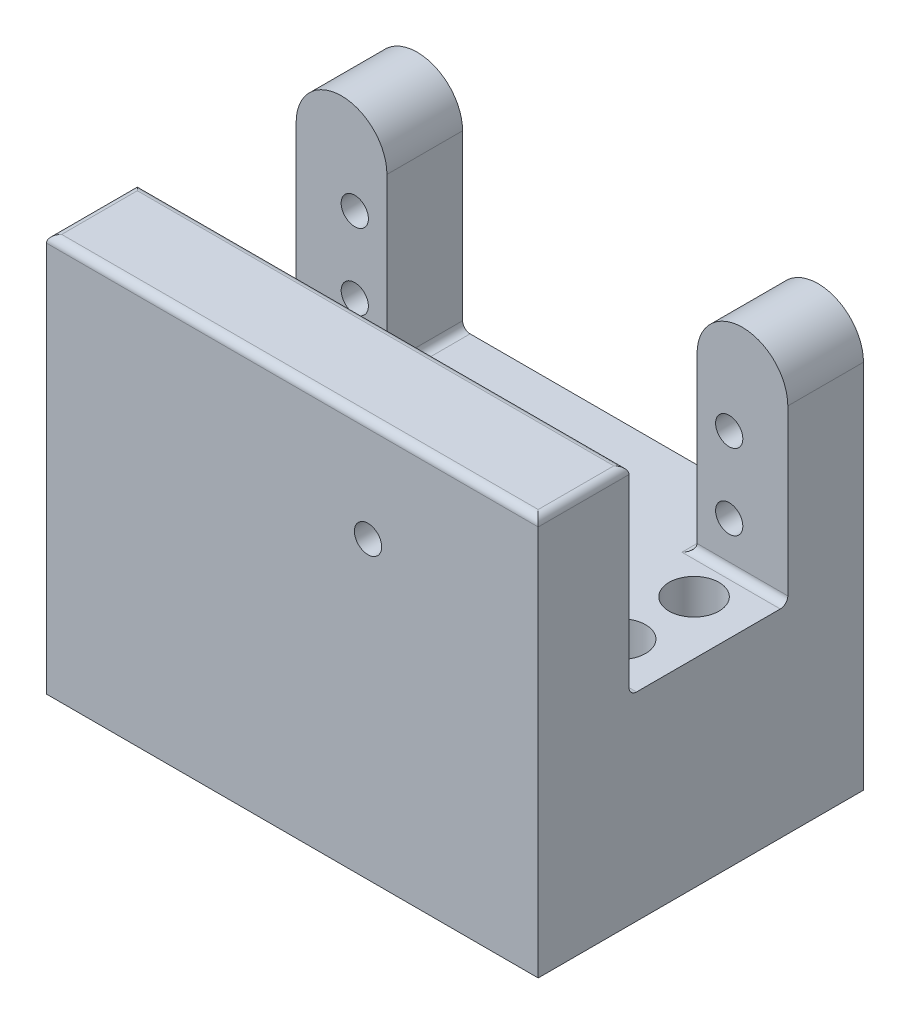
ISO-10303-21;
HEADER;
FILE_DESCRIPTION(('STEP AP214'),'2;1');
FILE_NAME('part.step','',(''),(''),'','','');
FILE_SCHEMA(('AUTOMOTIVE_DESIGN { 1 0 10303 214 1 1 1 1 }'));
ENDSEC;
DATA;
#1=APPLICATION_CONTEXT('core data for automotive mechanical design processes');
#2=APPLICATION_PROTOCOL_DEFINITION('international standard','automotive_design',2000,#1);
#3=PRODUCT_CONTEXT('',#1,'mechanical');
#4=PRODUCT('Part','Part','',(#3));
#5=PRODUCT_RELATED_PRODUCT_CATEGORY('part','',(#4));
#6=PRODUCT_DEFINITION_FORMATION('','',#4);
#7=PRODUCT_DEFINITION_CONTEXT('part definition',#1,'design');
#8=PRODUCT_DEFINITION('design','',#6,#7);
#9=PRODUCT_DEFINITION_SHAPE('','',#8);
#10=(LENGTH_UNIT() NAMED_UNIT(*) SI_UNIT(.MILLI.,.METRE.));
#11=(NAMED_UNIT(*) PLANE_ANGLE_UNIT() SI_UNIT($,.RADIAN.));
#12=(NAMED_UNIT(*) SI_UNIT($,.STERADIAN.) SOLID_ANGLE_UNIT());
#13=UNCERTAINTY_MEASURE_WITH_UNIT(LENGTH_MEASURE(1.E-05),#10,'distance_accuracy_value','');
#14=(GEOMETRIC_REPRESENTATION_CONTEXT(3) GLOBAL_UNCERTAINTY_ASSIGNED_CONTEXT((#13)) GLOBAL_UNIT_ASSIGNED_CONTEXT((#10,
#11,#12)) REPRESENTATION_CONTEXT('',''));
#15=CARTESIAN_POINT('',(0.,0.,0.));
#16=DIRECTION('',(0.,0.,1.));
#17=DIRECTION('',(1.,0.,0.));
#18=AXIS2_PLACEMENT_3D('',#15,#16,#17);
#19=CARTESIAN_POINT('',(0.,0.,31.));
#20=DIRECTION('',(0.,0.,1.));
#21=DIRECTION('',(1.,0.,0.));
#22=AXIS2_PLACEMENT_3D('',#19,#20,#21);
#23=PLANE('',#22);
#24=CARTESIAN_POINT('',(-16.4999999954684,4.31315850283263,31.));
#25=DIRECTION('',(0.,0.,1.));
#26=DIRECTION('',(1.,0.,0.));
#27=AXIS2_PLACEMENT_3D('',#24,#25,#26);
#28=CIRCLE('',#27,1.8);
#29=CARTESIAN_POINT('',(-14.6999999954684,4.31315850283263,31.));
#30=VERTEX_POINT('',#29);
#31=EDGE_CURVE('E216',#30,#30,#28,.F.);
#32=ORIENTED_EDGE('',*,*,#31,.F.);
#33=EDGE_LOOP('',(#32));
#34=FACE_BOUND('',#33,.T.);
#35=DIRECTION('',(0.,-1.,0.));
#36=VECTOR('',#35,1.);
#37=CARTESIAN_POINT('',(-59.,-20.6976744186047,31.));
#38=LINE('',#37,#36);
#39=CARTESIAN_POINT('',(-59.,16.9392946847438,31.));
#40=VERTEX_POINT('',#39);
#41=CARTESIAN_POINT('',(-59.,-7.44767441860465,31.));
#42=VERTEX_POINT('',#41);
#43=EDGE_CURVE('E284',#40,#42,#38,.T.);
#44=ORIENTED_EDGE('',*,*,#43,.F.);
#45=DIRECTION('',(-1.,0.,0.));
#46=VECTOR('',#45,1.);
#47=CARTESIAN_POINT('',(0.,16.9392946847438,31.));
#48=LINE('',#47,#46);
#49=CARTESIAN_POINT('',(6.00000000000001,16.9392946847438,31.));
#50=VERTEX_POINT('',#49);
#51=EDGE_CURVE('E345',#40,#50,#48,.F.);
#52=ORIENTED_EDGE('',*,*,#51,.T.);
#53=DIRECTION('',(0.,1.,0.));
#54=VECTOR('',#53,1.);
#55=CARTESIAN_POINT('',(6.00000000000001,-20.6976744186046,31.));
#56=LINE('',#55,#54);
#57=CARTESIAN_POINT('',(6.00000000000001,-7.44767441860465,31.));
#58=VERTEX_POINT('',#57);
#59=EDGE_CURVE('E278',#58,#50,#56,.T.);
#60=ORIENTED_EDGE('',*,*,#59,.F.);
#61=DIRECTION('',(1.,0.,0.));
#62=VECTOR('',#61,1.);
#63=CARTESIAN_POINT('',(0.,-7.44767441860465,31.));
#64=LINE('',#63,#62);
#65=EDGE_CURVE('E342',#58,#42,#64,.F.);
#66=ORIENTED_EDGE('',*,*,#65,.T.);
#67=EDGE_LOOP('',(#44,#52,#60,#66));
#68=FACE_BOUND('',#67,.T.);
#69=ADVANCED_FACE('F39',(#34,#68),#23,.F.);
#70=CARTESIAN_POINT('',(-6.,14.3023255813954,10.));
#71=DIRECTION('',(1.,0.,0.));
#72=DIRECTION('',(0.,1.,0.));
#73=AXIS2_PLACEMENT_3D('',#70,#71,#72);
#74=PLANE('',#73);
#75=DIRECTION('',(0.,-1.,0.));
#76=VECTOR('',#75,1.);
#77=CARTESIAN_POINT('',(-6.,14.3023255813954,0.));
#78=LINE('',#77,#76);
#79=CARTESIAN_POINT('',(-6.,14.3023255813954,0.));
#80=VERTEX_POINT('',#79);
#81=CARTESIAN_POINT('',(-6.,-7.44767441860465,0.));
#82=VERTEX_POINT('',#81);
#83=EDGE_CURVE('E313',#80,#82,#78,.T.);
#84=ORIENTED_EDGE('',*,*,#83,.T.);
#85=DIRECTION('',(0.,0.,1.));
#86=VECTOR('',#85,1.);
#87=CARTESIAN_POINT('',(-6.,-7.44767441860465,10.));
#88=LINE('',#87,#86);
#89=CARTESIAN_POINT('',(-6.,-7.44767441860465,10.));
#90=VERTEX_POINT('',#89);
#91=EDGE_CURVE('E378',#82,#90,#88,.T.);
#92=ORIENTED_EDGE('',*,*,#91,.T.);
#93=DIRECTION('',(0.,-1.,0.));
#94=VECTOR('',#93,1.);
#95=CARTESIAN_POINT('',(-6.,14.3023255813954,10.));
#96=LINE('',#95,#94);
#97=CARTESIAN_POINT('',(-6.,14.3023255813954,10.));
#98=VERTEX_POINT('',#97);
#99=EDGE_CURVE('E302',#98,#90,#96,.T.);
#100=ORIENTED_EDGE('',*,*,#99,.F.);
#101=DIRECTION('',(0.,0.,-1.));
#102=VECTOR('',#101,1.);
#103=CARTESIAN_POINT('',(-6.,14.3023255813954,10.));
#104=LINE('',#103,#102);
#105=EDGE_CURVE('E321',#98,#80,#104,.T.);
#106=ORIENTED_EDGE('',*,*,#105,.T.);
#107=EDGE_LOOP('',(#84,#92,#100,#106));
#108=FACE_BOUND('',#107,.T.);
#109=ADVANCED_FACE('F454',(#108),#74,.F.);
#110=CARTESIAN_POINT('',(-47.,-20.6976744186046,31.));
#111=DIRECTION('',(-1.,0.,0.));
#112=DIRECTION('',(0.,0.,1.));
#113=AXIS2_PLACEMENT_3D('',#110,#111,#112);
#114=PLANE('',#113);
#115=DIRECTION('',(0.,-1.,0.));
#116=VECTOR('',#115,1.);
#117=CARTESIAN_POINT('',(-47.,14.3023255813954,10.));
#118=LINE('',#117,#116);
#119=CARTESIAN_POINT('',(-47.,14.3023255813954,10.));
#120=VERTEX_POINT('',#119);
#121=CARTESIAN_POINT('',(-47.,-7.44767441860465,10.));
#122=VERTEX_POINT('',#121);
#123=EDGE_CURVE('E262',#120,#122,#118,.T.);
#124=ORIENTED_EDGE('',*,*,#123,.T.);
#125=DIRECTION('',(0.,0.,1.));
#126=VECTOR('',#125,1.);
#127=CARTESIAN_POINT('',(-47.,-7.44767441860465,31.));
#128=LINE('',#127,#126);
#129=CARTESIAN_POINT('',(-47.,-7.44767441860465,0.));
#130=VERTEX_POINT('',#129);
#131=EDGE_CURVE('E57',#122,#130,#128,.F.);
#132=ORIENTED_EDGE('',*,*,#131,.T.);
#133=DIRECTION('',(0.,-1.,0.));
#134=VECTOR('',#133,1.);
#135=CARTESIAN_POINT('',(-47.,14.3023255813954,0.));
#136=LINE('',#135,#134);
#137=CARTESIAN_POINT('',(-47.,14.3023255813954,0.));
#138=VERTEX_POINT('',#137);
#139=EDGE_CURVE('E180',#138,#130,#136,.T.);
#140=ORIENTED_EDGE('',*,*,#139,.F.);
#141=DIRECTION('',(0.,0.,-1.));
#142=VECTOR('',#141,1.);
#143=CARTESIAN_POINT('',(-47.,14.3023255813954,10.));
#144=LINE('',#143,#142);
#145=EDGE_CURVE('E265',#120,#138,#144,.T.);
#146=ORIENTED_EDGE('',*,*,#145,.F.);
#147=EDGE_LOOP('',(#124,#132,#140,#146));
#148=FACE_BOUND('',#147,.T.);
#149=ADVANCED_FACE('F497',(#148),#114,.F.);
#150=CARTESIAN_POINT('',(0.,14.3023255813954,10.));
#151=DIRECTION('',(0.,0.,-1.));
#152=DIRECTION('',(-1.,0.,0.));
#153=AXIS2_PLACEMENT_3D('',#150,#151,#152);
#154=PLANE('',#153);
#155=ORIENTED_EDGE('',*,*,#99,.T.);
#156=DIRECTION('',(1.,0.,0.));
#157=VECTOR('',#156,1.);
#158=CARTESIAN_POINT('',(0.,-7.44767441860465,10.));
#159=LINE('',#158,#157);
#160=CARTESIAN_POINT('',(6.,-7.44767441860465,10.));
#161=VERTEX_POINT('',#160);
#162=EDGE_CURVE('E374',#90,#161,#159,.T.);
#163=ORIENTED_EDGE('',*,*,#162,.T.);
#164=DIRECTION('',(0.,1.,0.));
#165=VECTOR('',#164,1.);
#166=CARTESIAN_POINT('',(6.,14.3023255813954,10.));
#167=LINE('',#166,#165);
#168=CARTESIAN_POINT('',(6.,14.3023255813954,10.));
#169=VERTEX_POINT('',#168);
#170=EDGE_CURVE('E306',#161,#169,#167,.T.);
#171=ORIENTED_EDGE('',*,*,#170,.T.);
#172=CARTESIAN_POINT('',(0.,14.3023255813954,10.));
#173=DIRECTION('',(0.,0.,1.));
#174=DIRECTION('',(-1.,0.,0.));
#175=AXIS2_PLACEMENT_3D('',#172,#173,#174);
#176=CIRCLE('',#175,6.);
#177=EDGE_CURVE('E298',#169,#98,#176,.T.);
#178=ORIENTED_EDGE('',*,*,#177,.T.);
#179=EDGE_LOOP('',(#155,#163,#171,#178));
#180=FACE_BOUND('',#179,.T.);
#181=CARTESIAN_POINT('',(-1.75,-2.44781916033438,10.));
#182=DIRECTION('',(0.,0.,-1.));
#183=DIRECTION('',(-1.,0.,0.));
#184=AXIS2_PLACEMENT_3D('',#181,#182,#183);
#185=CIRCLE('',#184,1.8);
#186=CARTESIAN_POINT('',(-3.55,-2.44781916033438,10.));
#187=VERTEX_POINT('',#186);
#188=EDGE_CURVE('E232',#187,#187,#185,.F.);
#189=ORIENTED_EDGE('',*,*,#188,.F.);
#190=EDGE_LOOP('',(#189));
#191=FACE_BOUND('',#190,.T.);
#192=CARTESIAN_POINT('',(-1.75,7.55218083966562,10.));
#193=DIRECTION('',(0.,0.,-1.));
#194=DIRECTION('',(-1.,0.,0.));
#195=AXIS2_PLACEMENT_3D('',#192,#193,#194);
#196=CIRCLE('',#195,1.8);
#197=CARTESIAN_POINT('',(-3.55,7.55218083966562,10.));
#198=VERTEX_POINT('',#197);
#199=EDGE_CURVE('E224',#198,#198,#196,.F.);
#200=ORIENTED_EDGE('',*,*,#199,.F.);
#201=EDGE_LOOP('',(#200));
#202=FACE_BOUND('',#201,.T.);
#203=ADVANCED_FACE('F449',(#180,#191,#202),#154,.F.);
#204=CARTESIAN_POINT('',(0.,14.3023255813954,10.));
#205=DIRECTION('',(0.,0.,-1.));
#206=DIRECTION('',(-1.,0.,0.));
#207=AXIS2_PLACEMENT_3D('',#204,#205,#206);
#208=CYLINDRICAL_SURFACE('',#207,6.);
#209=CARTESIAN_POINT('',(0.,14.3023255813954,0.));
#210=DIRECTION('',(0.,0.,1.));
#211=DIRECTION('',(-1.,0.,0.));
#212=AXIS2_PLACEMENT_3D('',#209,#210,#211);
#213=CIRCLE('',#212,6.);
#214=CARTESIAN_POINT('',(6.,14.3023255813954,0.));
#215=VERTEX_POINT('',#214);
#216=EDGE_CURVE('E297',#215,#80,#213,.T.);
#217=ORIENTED_EDGE('',*,*,#216,.T.);
#218=ORIENTED_EDGE('',*,*,#105,.F.);
#219=ORIENTED_EDGE('',*,*,#177,.F.);
#220=DIRECTION('',(0.,0.,-1.));
#221=VECTOR('',#220,1.);
#222=CARTESIAN_POINT('',(6.,14.3023255813954,10.));
#223=LINE('',#222,#221);
#224=EDGE_CURVE('E309',#169,#215,#223,.T.);
#225=ORIENTED_EDGE('',*,*,#224,.T.);
#226=EDGE_LOOP('',(#217,#218,#219,#225));
#227=FACE_BOUND('',#226,.T.);
#228=ADVANCED_FACE('F456',(#227),#208,.T.);
#229=CARTESIAN_POINT('',(6.,14.3023255813954,10.));
#230=DIRECTION('',(-1.,0.,0.));
#231=DIRECTION('',(0.,-1.,0.));
#232=AXIS2_PLACEMENT_3D('',#229,#230,#231);
#233=PLANE('',#232);
#234=ORIENTED_EDGE('',*,*,#59,.T.);
#235=DIRECTION('',(0.,0.,-1.));
#236=VECTOR('',#235,1.);
#237=CARTESIAN_POINT('',(6.,16.9392946847438,10.));
#238=LINE('',#237,#236);
#239=CARTESIAN_POINT('',(6.00000000000001,16.9392946847438,43.));
#240=VERTEX_POINT('',#239);
#241=EDGE_CURVE('E348',#50,#240,#238,.F.);
#242=ORIENTED_EDGE('',*,*,#241,.T.);
#243=DIRECTION('',(0.,1.,0.));
#244=VECTOR('',#243,1.);
#245=CARTESIAN_POINT('',(6.00000000000001,-20.6976744186046,43.));
#246=LINE('',#245,#244);
#247=CARTESIAN_POINT('',(6.00000000000001,-34.6976744186046,43.));
#248=VERTEX_POINT('',#247);
#249=EDGE_CURVE('E279',#248,#240,#246,.T.);
#250=ORIENTED_EDGE('',*,*,#249,.F.);
#251=DIRECTION('',(0.,0.,1.));
#252=VECTOR('',#251,1.);
#253=CARTESIAN_POINT('',(6.00000000000001,-34.6976744186046,43.));
#254=LINE('',#253,#252);
#255=CARTESIAN_POINT('',(6.00000000000001,-34.6976744186046,0.));
#256=VERTEX_POINT('',#255);
#257=EDGE_CURVE('E193',#256,#248,#254,.T.);
#258=ORIENTED_EDGE('',*,*,#257,.F.);
#259=DIRECTION('',(0.,1.,0.));
#260=VECTOR('',#259,1.);
#261=CARTESIAN_POINT('',(6.,14.3023255813954,0.));
#262=LINE('',#261,#260);
#263=EDGE_CURVE('E188',#256,#215,#262,.T.);
#264=ORIENTED_EDGE('',*,*,#263,.T.);
#265=ORIENTED_EDGE('',*,*,#224,.F.);
#266=ORIENTED_EDGE('',*,*,#170,.F.);
#267=CARTESIAN_POINT('',(6.,-7.44767441860465,11.));
#268=DIRECTION('',(-1.,0.,0.));
#269=DIRECTION('',(0.,-1.,0.));
#270=AXIS2_PLACEMENT_3D('',#267,#268,#269);
#271=CIRCLE('',#270,1.);
#272=CARTESIAN_POINT('',(6.00000000000001,-8.44767441860465,11.));
#273=VERTEX_POINT('',#272);
#274=EDGE_CURVE('E386',#161,#273,#271,.T.);
#275=ORIENTED_EDGE('',*,*,#274,.T.);
#276=DIRECTION('',(0.,0.,-1.));
#277=VECTOR('',#276,1.);
#278=CARTESIAN_POINT('',(6.00000000000001,-8.44767441860465,31.));
#279=LINE('',#278,#277);
#280=CARTESIAN_POINT('',(6.00000000000001,-8.44767441860465,30.));
#281=VERTEX_POINT('',#280);
#282=EDGE_CURVE('E287',#281,#273,#279,.T.);
#283=ORIENTED_EDGE('',*,*,#282,.F.);
#284=CARTESIAN_POINT('',(6.00000000000001,-7.44767441860465,30.));
#285=DIRECTION('',(-1.,0.,0.));
#286=DIRECTION('',(0.,-1.,0.));
#287=AXIS2_PLACEMENT_3D('',#284,#285,#286);
#288=CIRCLE('',#287,1.);
#289=EDGE_CURVE('E49',#281,#58,#288,.T.);
#290=ORIENTED_EDGE('',*,*,#289,.T.);
#291=EDGE_LOOP('',(#234,#242,#250,#258,#264,#265,#266,#275,#283,#290));
#292=FACE_BOUND('',#291,.T.);
#293=ADVANCED_FACE('F444',(#292),#233,.F.);
#294=CARTESIAN_POINT('',(0.,14.3023255813954,0.));
#295=DIRECTION('',(0.,0.,-1.));
#296=DIRECTION('',(-1.,0.,0.));
#297=AXIS2_PLACEMENT_3D('',#294,#295,#296);
#298=PLANE('',#297);
#299=CARTESIAN_POINT('',(-1.75,7.55218083966562,0.));
#300=DIRECTION('',(0.,0.,-1.));
#301=DIRECTION('',(-1.,0.,0.));
#302=AXIS2_PLACEMENT_3D('',#299,#300,#301);
#303=CIRCLE('',#302,1.8);
#304=CARTESIAN_POINT('',(-3.55,7.55218083966562,0.));
#305=VERTEX_POINT('',#304);
#306=EDGE_CURVE('E220',#305,#305,#303,.T.);
#307=ORIENTED_EDGE('',*,*,#306,.F.);
#308=EDGE_LOOP('',(#307));
#309=FACE_BOUND('',#308,.T.);
#310=CARTESIAN_POINT('',(-1.75,-2.44781916033438,0.));
#311=DIRECTION('',(0.,0.,-1.));
#312=DIRECTION('',(-1.,0.,0.));
#313=AXIS2_PLACEMENT_3D('',#310,#311,#312);
#314=CIRCLE('',#313,1.8);
#315=CARTESIAN_POINT('',(-3.55,-2.44781916033438,0.));
#316=VERTEX_POINT('',#315);
#317=EDGE_CURVE('E228',#316,#316,#314,.T.);
#318=ORIENTED_EDGE('',*,*,#317,.F.);
#319=EDGE_LOOP('',(#318));
#320=FACE_BOUND('',#319,.T.);
#321=ORIENTED_EDGE('',*,*,#216,.F.);
#322=ORIENTED_EDGE('',*,*,#263,.F.);
#323=DIRECTION('',(1.,0.,0.));
#324=VECTOR('',#323,1.);
#325=CARTESIAN_POINT('',(-59.,-34.6976744186046,0.));
#326=LINE('',#325,#324);
#327=CARTESIAN_POINT('',(-59.,-34.6976744186046,0.));
#328=VERTEX_POINT('',#327);
#329=EDGE_CURVE('E184',#328,#256,#326,.T.);
#330=ORIENTED_EDGE('',*,*,#329,.F.);
#331=DIRECTION('',(0.,1.,0.));
#332=VECTOR('',#331,1.);
#333=CARTESIAN_POINT('',(-59.,14.3023255813954,0.));
#334=LINE('',#333,#332);
#335=CARTESIAN_POINT('',(-59.,14.3023255813954,0.));
#336=VERTEX_POINT('',#335);
#337=EDGE_CURVE('E169',#328,#336,#334,.T.);
#338=ORIENTED_EDGE('',*,*,#337,.T.);
#339=CARTESIAN_POINT('',(-53.,14.3023255813954,0.));
#340=DIRECTION('',(0.,0.,-1.));
#341=DIRECTION('',(1.,0.,0.));
#342=AXIS2_PLACEMENT_3D('',#339,#340,#341);
#343=CIRCLE('',#342,6.);
#344=EDGE_CURVE('E181',#336,#138,#343,.T.);
#345=ORIENTED_EDGE('',*,*,#344,.T.);
#346=ORIENTED_EDGE('',*,*,#139,.T.);
#347=CARTESIAN_POINT('',(-46.,-7.44767441860465,0.));
#348=DIRECTION('',(0.,0.,-1.));
#349=DIRECTION('',(-1.,0.,0.));
#350=AXIS2_PLACEMENT_3D('',#347,#348,#349);
#351=CIRCLE('',#350,1.);
#352=CARTESIAN_POINT('',(-46.,-8.44767441860465,0.));
#353=VERTEX_POINT('',#352);
#354=EDGE_CURVE('E391',#130,#353,#351,.F.);
#355=ORIENTED_EDGE('',*,*,#354,.T.);
#356=DIRECTION('',(1.,0.,0.));
#357=VECTOR('',#356,1.);
#358=CARTESIAN_POINT('',(-5.99999999999999,-8.44767441860465,0.));
#359=LINE('',#358,#357);
#360=CARTESIAN_POINT('',(-7.,-8.44767441860465,0.));
#361=VERTEX_POINT('',#360);
#362=EDGE_CURVE('E212',#353,#361,#359,.T.);
#363=ORIENTED_EDGE('',*,*,#362,.T.);
#364=CARTESIAN_POINT('',(-7.,-7.44767441860465,0.));
#365=DIRECTION('',(0.,0.,-1.));
#366=DIRECTION('',(-1.,0.,0.));
#367=AXIS2_PLACEMENT_3D('',#364,#365,#366);
#368=CIRCLE('',#367,1.);
#369=EDGE_CURVE('E65',#361,#82,#368,.F.);
#370=ORIENTED_EDGE('',*,*,#369,.T.);
#371=ORIENTED_EDGE('',*,*,#83,.F.);
#372=EDGE_LOOP('',(#321,#322,#330,#338,#345,#346,#355,#363,#370,#371));
#373=FACE_BOUND('',#372,.T.);
#374=CARTESIAN_POINT('',(-51.25,8.00000000000001,0.));
#375=DIRECTION('',(0.,0.,-1.));
#376=DIRECTION('',(-1.,0.,0.));
#377=AXIS2_PLACEMENT_3D('',#374,#375,#376);
#378=CIRCLE('',#377,1.8);
#379=CARTESIAN_POINT('',(-53.05,8.00000000000001,0.));
#380=VERTEX_POINT('',#379);
#381=EDGE_CURVE('E236',#380,#380,#378,.T.);
#382=ORIENTED_EDGE('',*,*,#381,.F.);
#383=EDGE_LOOP('',(#382));
#384=FACE_BOUND('',#383,.T.);
#385=CARTESIAN_POINT('',(-51.25,-1.99999999999999,0.));
#386=DIRECTION('',(0.,0.,-1.));
#387=DIRECTION('',(-1.,0.,0.));
#388=AXIS2_PLACEMENT_3D('',#385,#386,#387);
#389=CIRCLE('',#388,1.8);
#390=CARTESIAN_POINT('',(-53.05,-1.99999999999999,0.));
#391=VERTEX_POINT('',#390);
#392=EDGE_CURVE('E247',#391,#391,#389,.T.);
#393=ORIENTED_EDGE('',*,*,#392,.F.);
#394=EDGE_LOOP('',(#393));
#395=FACE_BOUND('',#394,.T.);
#396=ADVANCED_FACE('F186',(#309,#320,#373,#384,#395),#298,.T.);
#397=CARTESIAN_POINT('',(-5.99999999999999,-8.44767441860465,31.));
#398=DIRECTION('',(0.,1.,0.));
#399=DIRECTION('',(0.,0.,1.));
#400=AXIS2_PLACEMENT_3D('',#397,#398,#399);
#401=PLANE('',#400);
#402=CARTESIAN_POINT('',(-1.09999999999998,-8.44767441860465,15.2999999999999));
#403=DIRECTION('',(0.,1.,0.));
#404=DIRECTION('',(0.,0.,1.));
#405=AXIS2_PLACEMENT_3D('',#402,#403,#404);
#406=CIRCLE('',#405,3.29999999999999);
#407=CARTESIAN_POINT('',(-1.09999999999998,-8.44767441860465,18.5999999999999));
#408=VERTEX_POINT('',#407);
#409=EDGE_CURVE('E856',#408,#408,#406,.T.);
#410=ORIENTED_EDGE('',*,*,#409,.F.);
#411=EDGE_LOOP('',(#410));
#412=FACE_BOUND('',#411,.T.);
#413=CARTESIAN_POINT('',(-1.09999999999998,-8.44767441860465,25.));
#414=DIRECTION('',(0.,1.,0.));
#415=DIRECTION('',(0.,0.,1.));
#416=AXIS2_PLACEMENT_3D('',#413,#414,#415);
#417=CIRCLE('',#416,3.29999999999999);
#418=CARTESIAN_POINT('',(-1.09999999999998,-8.44767441860465,28.3));
#419=VERTEX_POINT('',#418);
#420=EDGE_CURVE('E850',#419,#419,#417,.T.);
#421=ORIENTED_EDGE('',*,*,#420,.F.);
#422=EDGE_LOOP('',(#421));
#423=FACE_BOUND('',#422,.T.);
#424=CARTESIAN_POINT('',(-51.9,-8.44767441860465,15.2999999999999));
#425=DIRECTION('',(0.,1.,0.));
#426=DIRECTION('',(0.,0.,1.));
#427=AXIS2_PLACEMENT_3D('',#424,#425,#426);
#428=CIRCLE('',#427,3.29999999999999);
#429=CARTESIAN_POINT('',(-51.9,-8.44767441860465,18.5999999999999));
#430=VERTEX_POINT('',#429);
#431=EDGE_CURVE('E843',#430,#430,#428,.T.);
#432=ORIENTED_EDGE('',*,*,#431,.F.);
#433=EDGE_LOOP('',(#432));
#434=FACE_BOUND('',#433,.T.);
#435=CARTESIAN_POINT('',(-51.9,-8.44767441860465,25.));
#436=DIRECTION('',(0.,1.,0.));
#437=DIRECTION('',(0.,0.,1.));
#438=AXIS2_PLACEMENT_3D('',#435,#436,#437);
#439=CIRCLE('',#438,3.29999999999999);
#440=CARTESIAN_POINT('',(-51.9,-8.44767441860465,28.3));
#441=VERTEX_POINT('',#440);
#442=EDGE_CURVE('E200',#441,#441,#439,.T.);
#443=ORIENTED_EDGE('',*,*,#442,.F.);
#444=EDGE_LOOP('',(#443));
#445=FACE_BOUND('',#444,.T.);
#446=ORIENTED_EDGE('',*,*,#282,.T.);
#447=DIRECTION('',(1.,0.,0.));
#448=VECTOR('',#447,1.);
#449=CARTESIAN_POINT('',(-5.99999999999999,-8.44767441860465,11.));
#450=LINE('',#449,#448);
#451=CARTESIAN_POINT('',(-7.,-8.44767441860465,11.));
#452=VERTEX_POINT('',#451);
#453=EDGE_CURVE('E368',#273,#452,#450,.F.);
#454=ORIENTED_EDGE('',*,*,#453,.T.);
#455=DIRECTION('',(0.,0.,1.));
#456=VECTOR('',#455,1.);
#457=CARTESIAN_POINT('',(-7.,-8.44767441860465,31.));
#458=LINE('',#457,#456);
#459=EDGE_CURVE('E365',#452,#361,#458,.F.);
#460=ORIENTED_EDGE('',*,*,#459,.T.);
#461=ORIENTED_EDGE('',*,*,#362,.F.);
#462=DIRECTION('',(0.,0.,1.));
#463=VECTOR('',#462,1.);
#464=CARTESIAN_POINT('',(-46.,-8.44767441860465,31.));
#465=LINE('',#464,#463);
#466=CARTESIAN_POINT('',(-46.,-8.44767441860465,11.));
#467=VERTEX_POINT('',#466);
#468=EDGE_CURVE('E358',#353,#467,#465,.T.);
#469=ORIENTED_EDGE('',*,*,#468,.T.);
#470=DIRECTION('',(-1.,0.,0.));
#471=VECTOR('',#470,1.);
#472=CARTESIAN_POINT('',(-5.99999999999999,-8.44767441860465,11.));
#473=LINE('',#472,#471);
#474=CARTESIAN_POINT('',(-59.,-8.44767441860465,11.));
#475=VERTEX_POINT('',#474);
#476=EDGE_CURVE('E361',#467,#475,#473,.T.);
#477=ORIENTED_EDGE('',*,*,#476,.T.);
#478=DIRECTION('',(0.,0.,-1.));
#479=VECTOR('',#478,1.);
#480=CARTESIAN_POINT('',(-59.,-8.44767441860465,31.));
#481=LINE('',#480,#479);
#482=CARTESIAN_POINT('',(-59.,-8.44767441860465,30.));
#483=VERTEX_POINT('',#482);
#484=EDGE_CURVE('E274',#483,#475,#481,.T.);
#485=ORIENTED_EDGE('',*,*,#484,.F.);
#486=DIRECTION('',(1.,0.,0.));
#487=VECTOR('',#486,1.);
#488=CARTESIAN_POINT('',(-5.99999999999999,-8.44767441860465,30.));
#489=LINE('',#488,#487);
#490=EDGE_CURVE('E354',#483,#281,#489,.T.);
#491=ORIENTED_EDGE('',*,*,#490,.T.);
#492=EDGE_LOOP('',(#446,#454,#460,#461,#469,#477,#485,#491));
#493=FACE_BOUND('',#492,.T.);
#494=ADVANCED_FACE('F430',(#412,#423,#434,#445,#493),#401,.T.);
#495=CARTESIAN_POINT('',(6.00000000000001,17.9392946847438,43.));
#496=DIRECTION('',(0.,-1.,0.));
#497=DIRECTION('',(1.,0.,0.));
#498=AXIS2_PLACEMENT_3D('',#495,#496,#497);
#499=PLANE('',#498);
#500=DIRECTION('',(-1.,0.,0.));
#501=VECTOR('',#500,1.);
#502=CARTESIAN_POINT('',(6.00000000000001,17.9392946847438,42.));
#503=LINE('',#502,#501);
#504=CARTESIAN_POINT('',(-58.,17.9392946847438,42.));
#505=VERTEX_POINT('',#504);
#506=CARTESIAN_POINT('',(5.,17.9392946847438,42.));
#507=VERTEX_POINT('',#506);
#508=EDGE_CURVE('E335',#505,#507,#503,.F.);
#509=ORIENTED_EDGE('',*,*,#508,.T.);
#510=DIRECTION('',(0.,0.,-1.));
#511=VECTOR('',#510,1.);
#512=CARTESIAN_POINT('',(5.,17.9392946847438,43.));
#513=LINE('',#512,#511);
#514=CARTESIAN_POINT('',(5.,17.9392946847438,32.));
#515=VERTEX_POINT('',#514);
#516=EDGE_CURVE('E339',#507,#515,#513,.T.);
#517=ORIENTED_EDGE('',*,*,#516,.T.);
#518=DIRECTION('',(-1.,0.,0.));
#519=VECTOR('',#518,1.);
#520=CARTESIAN_POINT('',(6.00000000000001,17.9392946847438,32.));
#521=LINE('',#520,#519);
#522=CARTESIAN_POINT('',(-58.,17.9392946847438,32.));
#523=VERTEX_POINT('',#522);
#524=EDGE_CURVE('E332',#515,#523,#521,.T.);
#525=ORIENTED_EDGE('',*,*,#524,.T.);
#526=DIRECTION('',(0.,0.,-1.));
#527=VECTOR('',#526,1.);
#528=CARTESIAN_POINT('',(-58.,17.9392946847438,43.));
#529=LINE('',#528,#527);
#530=EDGE_CURVE('E329',#523,#505,#529,.F.);
#531=ORIENTED_EDGE('',*,*,#530,.T.);
#532=EDGE_LOOP('',(#509,#517,#525,#531));
#533=FACE_BOUND('',#532,.T.);
#534=ADVANCED_FACE('F476',(#533),#499,.F.);
#535=CARTESIAN_POINT('',(-59.,-20.6976744186047,43.));
#536=DIRECTION('',(1.,0.,0.));
#537=DIRECTION('',(0.,0.,-1.));
#538=AXIS2_PLACEMENT_3D('',#535,#536,#537);
#539=PLANE('',#538);
#540=DIRECTION('',(0.,-1.,0.));
#541=VECTOR('',#540,1.);
#542=CARTESIAN_POINT('',(-59.,-20.6976744186047,43.));
#543=LINE('',#542,#541);
#544=CARTESIAN_POINT('',(-59.,16.9392946847438,43.));
#545=VERTEX_POINT('',#544);
#546=CARTESIAN_POINT('',(-59.,-34.6976744186046,43.));
#547=VERTEX_POINT('',#546);
#548=EDGE_CURVE('E283',#545,#547,#543,.T.);
#549=ORIENTED_EDGE('',*,*,#548,.F.);
#550=DIRECTION('',(0.,0.,-1.));
#551=VECTOR('',#550,1.);
#552=CARTESIAN_POINT('',(-59.,16.9392946847438,43.));
#553=LINE('',#552,#551);
#554=EDGE_CURVE('E351',#545,#40,#553,.T.);
#555=ORIENTED_EDGE('',*,*,#554,.T.);
#556=ORIENTED_EDGE('',*,*,#43,.T.);
#557=CARTESIAN_POINT('',(-59.,-7.44767441860465,30.));
#558=DIRECTION('',(1.,0.,0.));
#559=DIRECTION('',(0.,0.,-1.));
#560=AXIS2_PLACEMENT_3D('',#557,#558,#559);
#561=CIRCLE('',#560,1.);
#562=EDGE_CURVE('E11',#42,#483,#561,.T.);
#563=ORIENTED_EDGE('',*,*,#562,.T.);
#564=ORIENTED_EDGE('',*,*,#484,.T.);
#565=CARTESIAN_POINT('',(-59.,-7.44767441860465,11.));
#566=DIRECTION('',(1.,0.,0.));
#567=DIRECTION('',(0.,0.,-1.));
#568=AXIS2_PLACEMENT_3D('',#565,#566,#567);
#569=CIRCLE('',#568,1.);
#570=CARTESIAN_POINT('',(-59.,-7.44767441860465,10.));
#571=VERTEX_POINT('',#570);
#572=EDGE_CURVE('E383',#475,#571,#569,.T.);
#573=ORIENTED_EDGE('',*,*,#572,.T.);
#574=DIRECTION('',(0.,1.,0.));
#575=VECTOR('',#574,1.);
#576=CARTESIAN_POINT('',(-59.,14.3023255813954,10.));
#577=LINE('',#576,#575);
#578=CARTESIAN_POINT('',(-59.,14.3023255813954,10.));
#579=VERTEX_POINT('',#578);
#580=EDGE_CURVE('E259',#571,#579,#577,.T.);
#581=ORIENTED_EDGE('',*,*,#580,.T.);
#582=DIRECTION('',(0.,0.,-1.));
#583=VECTOR('',#582,1.);
#584=CARTESIAN_POINT('',(-59.,14.3023255813954,10.));
#585=LINE('',#584,#583);
#586=EDGE_CURVE('E176',#579,#336,#585,.T.);
#587=ORIENTED_EDGE('',*,*,#586,.T.);
#588=ORIENTED_EDGE('',*,*,#337,.F.);
#589=DIRECTION('',(0.,0.,-1.));
#590=VECTOR('',#589,1.);
#591=CARTESIAN_POINT('',(-59.,-34.6976744186046,43.));
#592=LINE('',#591,#590);
#593=EDGE_CURVE('E174',#547,#328,#592,.T.);
#594=ORIENTED_EDGE('',*,*,#593,.F.);
#595=EDGE_LOOP('',(#549,#555,#556,#563,#564,#573,#581,#587,#588,#594));
#596=FACE_BOUND('',#595,.T.);
#597=ADVANCED_FACE('F172',(#596),#539,.F.);
#598=CARTESIAN_POINT('',(0.,0.,43.));
#599=DIRECTION('',(0.,0.,1.));
#600=DIRECTION('',(1.,0.,0.));
#601=AXIS2_PLACEMENT_3D('',#598,#599,#600);
#602=PLANE('',#601);
#603=CARTESIAN_POINT('',(-16.4999999954684,4.31315850283263,43.));
#604=DIRECTION('',(0.,0.,1.));
#605=DIRECTION('',(1.,0.,0.));
#606=AXIS2_PLACEMENT_3D('',#603,#604,#605);
#607=CIRCLE('',#606,1.8);
#608=CARTESIAN_POINT('',(-14.6999999954684,4.31315850283263,43.));
#609=VERTEX_POINT('',#608);
#610=EDGE_CURVE('E215',#609,#609,#607,.T.);
#611=ORIENTED_EDGE('',*,*,#610,.F.);
#612=EDGE_LOOP('',(#611));
#613=FACE_BOUND('',#612,.T.);
#614=ORIENTED_EDGE('',*,*,#249,.T.);
#615=DIRECTION('',(-1.,0.,0.));
#616=VECTOR('',#615,1.);
#617=CARTESIAN_POINT('',(-59.,16.9392946847438,43.));
#618=LINE('',#617,#616);
#619=EDGE_CURVE('E325',#240,#545,#618,.T.);
#620=ORIENTED_EDGE('',*,*,#619,.T.);
#621=ORIENTED_EDGE('',*,*,#548,.T.);
#622=DIRECTION('',(-1.,0.,0.));
#623=VECTOR('',#622,1.);
#624=CARTESIAN_POINT('',(-59.,-34.6976744186046,43.));
#625=LINE('',#624,#623);
#626=EDGE_CURVE('E198',#248,#547,#625,.T.);
#627=ORIENTED_EDGE('',*,*,#626,.F.);
#628=EDGE_LOOP('',(#614,#620,#621,#627));
#629=FACE_BOUND('',#628,.T.);
#630=ADVANCED_FACE('F458',(#613,#629),#602,.T.);
#631=CARTESIAN_POINT('',(-53.,14.3023255813954,10.));
#632=DIRECTION('',(0.,0.,-1.));
#633=DIRECTION('',(1.,0.,0.));
#634=AXIS2_PLACEMENT_3D('',#631,#632,#633);
#635=PLANE('',#634);
#636=CARTESIAN_POINT('',(-51.25,8.00000000000001,10.));
#637=DIRECTION('',(0.,0.,-1.));
#638=DIRECTION('',(-1.,0.,0.));
#639=AXIS2_PLACEMENT_3D('',#636,#637,#638);
#640=CIRCLE('',#639,1.8);
#641=CARTESIAN_POINT('',(-53.05,8.00000000000001,10.));
#642=VERTEX_POINT('',#641);
#643=EDGE_CURVE('E243',#642,#642,#640,.T.);
#644=ORIENTED_EDGE('',*,*,#643,.T.);
#645=EDGE_LOOP('',(#644));
#646=FACE_BOUND('',#645,.T.);
#647=CARTESIAN_POINT('',(-51.25,-1.99999999999999,10.));
#648=DIRECTION('',(0.,0.,-1.));
#649=DIRECTION('',(-1.,0.,0.));
#650=AXIS2_PLACEMENT_3D('',#647,#648,#649);
#651=CIRCLE('',#650,1.8);
#652=CARTESIAN_POINT('',(-53.05,-1.99999999999999,10.));
#653=VERTEX_POINT('',#652);
#654=EDGE_CURVE('E251',#653,#653,#651,.T.);
#655=ORIENTED_EDGE('',*,*,#654,.T.);
#656=EDGE_LOOP('',(#655));
#657=FACE_BOUND('',#656,.T.);
#658=ORIENTED_EDGE('',*,*,#580,.F.);
#659=DIRECTION('',(-1.,0.,0.));
#660=VECTOR('',#659,1.);
#661=CARTESIAN_POINT('',(-53.,-7.44767441860465,10.));
#662=LINE('',#661,#660);
#663=EDGE_CURVE('E371',#571,#122,#662,.F.);
#664=ORIENTED_EDGE('',*,*,#663,.T.);
#665=ORIENTED_EDGE('',*,*,#123,.F.);
#666=CARTESIAN_POINT('',(-53.,14.3023255813954,10.));
#667=DIRECTION('',(0.,0.,-1.));
#668=DIRECTION('',(1.,0.,0.));
#669=AXIS2_PLACEMENT_3D('',#666,#667,#668);
#670=CIRCLE('',#669,6.);
#671=EDGE_CURVE('E255',#579,#120,#670,.T.);
#672=ORIENTED_EDGE('',*,*,#671,.F.);
#673=EDGE_LOOP('',(#658,#664,#665,#672));
#674=FACE_BOUND('',#673,.T.);
#675=ADVANCED_FACE('F632',(#646,#657,#674),#635,.F.);
#676=CARTESIAN_POINT('',(-53.,14.3023255813954,10.));
#677=DIRECTION('',(0.,0.,-1.));
#678=DIRECTION('',(-1.,0.,0.));
#679=AXIS2_PLACEMENT_3D('',#676,#677,#678);
#680=CYLINDRICAL_SURFACE('',#679,6.);
#681=ORIENTED_EDGE('',*,*,#344,.F.);
#682=ORIENTED_EDGE('',*,*,#586,.F.);
#683=ORIENTED_EDGE('',*,*,#671,.T.);
#684=ORIENTED_EDGE('',*,*,#145,.T.);
#685=EDGE_LOOP('',(#681,#682,#683,#684));
#686=FACE_BOUND('',#685,.T.);
#687=ADVANCED_FACE('F688',(#686),#680,.T.);
#688=CARTESIAN_POINT('',(-51.25,-1.99999999999999,0.));
#689=DIRECTION('',(0.,0.,-1.));
#690=DIRECTION('',(-1.,0.,0.));
#691=AXIS2_PLACEMENT_3D('',#688,#689,#690);
#692=CYLINDRICAL_SURFACE('',#691,1.8);
#693=ORIENTED_EDGE('',*,*,#654,.F.);
#694=EDGE_LOOP('',(#693));
#695=FACE_BOUND('',#694,.T.);
#696=ORIENTED_EDGE('',*,*,#392,.T.);
#697=EDGE_LOOP('',(#696));
#698=FACE_BOUND('',#697,.T.);
#699=ADVANCED_FACE('F695',(#695,#698),#692,.F.);
#700=CARTESIAN_POINT('',(-51.25,8.00000000000001,0.));
#701=DIRECTION('',(0.,0.,-1.));
#702=DIRECTION('',(-1.,0.,0.));
#703=AXIS2_PLACEMENT_3D('',#700,#701,#702);
#704=CYLINDRICAL_SURFACE('',#703,1.8);
#705=ORIENTED_EDGE('',*,*,#643,.F.);
#706=EDGE_LOOP('',(#705));
#707=FACE_BOUND('',#706,.T.);
#708=ORIENTED_EDGE('',*,*,#381,.T.);
#709=EDGE_LOOP('',(#708));
#710=FACE_BOUND('',#709,.T.);
#711=ADVANCED_FACE('F704',(#707,#710),#704,.F.);
#712=CARTESIAN_POINT('',(-1.75,-2.44781916033438,0.));
#713=DIRECTION('',(0.,0.,-1.));
#714=DIRECTION('',(-1.,0.,0.));
#715=AXIS2_PLACEMENT_3D('',#712,#713,#714);
#716=CYLINDRICAL_SURFACE('',#715,1.8);
#717=ORIENTED_EDGE('',*,*,#188,.T.);
#718=EDGE_LOOP('',(#717));
#719=FACE_BOUND('',#718,.T.);
#720=ORIENTED_EDGE('',*,*,#317,.T.);
#721=EDGE_LOOP('',(#720));
#722=FACE_BOUND('',#721,.T.);
#723=ADVANCED_FACE('F712',(#719,#722),#716,.F.);
#724=CARTESIAN_POINT('',(-1.75,7.55218083966562,0.));
#725=DIRECTION('',(0.,0.,-1.));
#726=DIRECTION('',(-1.,0.,0.));
#727=AXIS2_PLACEMENT_3D('',#724,#725,#726);
#728=CYLINDRICAL_SURFACE('',#727,1.8);
#729=ORIENTED_EDGE('',*,*,#199,.T.);
#730=EDGE_LOOP('',(#729));
#731=FACE_BOUND('',#730,.T.);
#732=ORIENTED_EDGE('',*,*,#306,.T.);
#733=EDGE_LOOP('',(#732));
#734=FACE_BOUND('',#733,.T.);
#735=ADVANCED_FACE('F720',(#731,#734),#728,.F.);
#736=CARTESIAN_POINT('',(-16.4999999954684,4.31315850283263,43.));
#737=DIRECTION('',(0.,0.,1.));
#738=DIRECTION('',(1.,0.,0.));
#739=AXIS2_PLACEMENT_3D('',#736,#737,#738);
#740=CYLINDRICAL_SURFACE('',#739,1.8);
#741=ORIENTED_EDGE('',*,*,#31,.T.);
#742=EDGE_LOOP('',(#741));
#743=FACE_BOUND('',#742,.T.);
#744=ORIENTED_EDGE('',*,*,#610,.T.);
#745=EDGE_LOOP('',(#744));
#746=FACE_BOUND('',#745,.T.);
#747=ADVANCED_FACE('F621',(#743,#746),#740,.F.);
#748=CARTESIAN_POINT('',(0.,-34.6976744186046,0.));
#749=DIRECTION('',(0.,-1.,0.));
#750=DIRECTION('',(0.,0.,-1.));
#751=AXIS2_PLACEMENT_3D('',#748,#749,#750);
#752=PLANE('',#751);
#753=CARTESIAN_POINT('',(-1.09999999999998,-34.6976744186046,15.2999999999999));
#754=DIRECTION('',(0.,-1.,0.));
#755=DIRECTION('',(0.,0.,-1.));
#756=AXIS2_PLACEMENT_3D('',#753,#754,#755);
#757=CIRCLE('',#756,3.29999999999999);
#758=CARTESIAN_POINT('',(-1.09999999999998,-34.6976744186046,11.9999999999999));
#759=VERTEX_POINT('',#758);
#760=EDGE_CURVE('E410',#759,#759,#757,.T.);
#761=ORIENTED_EDGE('',*,*,#760,.F.);
#762=EDGE_LOOP('',(#761));
#763=FACE_BOUND('',#762,.T.);
#764=CARTESIAN_POINT('',(-1.09999999999998,-34.6976744186046,25.));
#765=DIRECTION('',(0.,-1.,0.));
#766=DIRECTION('',(0.,0.,-1.));
#767=AXIS2_PLACEMENT_3D('',#764,#765,#766);
#768=CIRCLE('',#767,3.29999999999999);
#769=CARTESIAN_POINT('',(-1.09999999999998,-34.6976744186046,21.7));
#770=VERTEX_POINT('',#769);
#771=EDGE_CURVE('E834',#770,#770,#768,.T.);
#772=ORIENTED_EDGE('',*,*,#771,.F.);
#773=EDGE_LOOP('',(#772));
#774=FACE_BOUND('',#773,.T.);
#775=CARTESIAN_POINT('',(-51.9,-34.6976744186046,15.2999999999999));
#776=DIRECTION('',(0.,-1.,0.));
#777=DIRECTION('',(0.,0.,-1.));
#778=AXIS2_PLACEMENT_3D('',#775,#776,#777);
#779=CIRCLE('',#778,3.29999999999999);
#780=CARTESIAN_POINT('',(-51.9,-34.6976744186046,11.9999999999999));
#781=VERTEX_POINT('',#780);
#782=EDGE_CURVE('E838',#781,#781,#779,.T.);
#783=ORIENTED_EDGE('',*,*,#782,.F.);
#784=EDGE_LOOP('',(#783));
#785=FACE_BOUND('',#784,.T.);
#786=CARTESIAN_POINT('',(-51.9,-34.6976744186046,25.));
#787=DIRECTION('',(0.,-1.,0.));
#788=DIRECTION('',(0.,0.,-1.));
#789=AXIS2_PLACEMENT_3D('',#786,#787,#788);
#790=CIRCLE('',#789,3.29999999999999);
#791=CARTESIAN_POINT('',(-51.9,-34.6976744186046,21.7));
#792=VERTEX_POINT('',#791);
#793=EDGE_CURVE('E204',#792,#792,#790,.T.);
#794=ORIENTED_EDGE('',*,*,#793,.F.);
#795=EDGE_LOOP('',(#794));
#796=FACE_BOUND('',#795,.T.);
#797=ORIENTED_EDGE('',*,*,#593,.T.);
#798=ORIENTED_EDGE('',*,*,#329,.T.);
#799=ORIENTED_EDGE('',*,*,#257,.T.);
#800=ORIENTED_EDGE('',*,*,#626,.T.);
#801=EDGE_LOOP('',(#797,#798,#799,#800));
#802=FACE_BOUND('',#801,.T.);
#803=ADVANCED_FACE('F196',(#763,#774,#785,#796,#802),#752,.T.);
#804=CARTESIAN_POINT('',(-51.9,-34.6976744186046,25.));
#805=DIRECTION('',(0.,-1.,0.));
#806=DIRECTION('',(0.,0.,-1.));
#807=AXIS2_PLACEMENT_3D('',#804,#805,#806);
#808=CYLINDRICAL_SURFACE('',#807,3.29999999999999);
#809=ORIENTED_EDGE('',*,*,#442,.T.);
#810=EDGE_LOOP('',(#809));
#811=FACE_BOUND('',#810,.T.);
#812=ORIENTED_EDGE('',*,*,#793,.T.);
#813=EDGE_LOOP('',(#812));
#814=FACE_BOUND('',#813,.T.);
#815=ADVANCED_FACE('F604',(#811,#814),#808,.F.);
#816=CARTESIAN_POINT('',(-51.9,-34.6976744186046,15.2999999999999));
#817=DIRECTION('',(0.,-1.,0.));
#818=DIRECTION('',(0.,0.,-1.));
#819=AXIS2_PLACEMENT_3D('',#816,#817,#818);
#820=CYLINDRICAL_SURFACE('',#819,3.29999999999999);
#821=ORIENTED_EDGE('',*,*,#431,.T.);
#822=EDGE_LOOP('',(#821));
#823=FACE_BOUND('',#822,.T.);
#824=ORIENTED_EDGE('',*,*,#782,.T.);
#825=EDGE_LOOP('',(#824));
#826=FACE_BOUND('',#825,.T.);
#827=ADVANCED_FACE('F595',(#823,#826),#820,.F.);
#828=CARTESIAN_POINT('',(-1.09999999999998,-34.6976744186046,25.));
#829=DIRECTION('',(0.,-1.,0.));
#830=DIRECTION('',(0.,0.,-1.));
#831=AXIS2_PLACEMENT_3D('',#828,#829,#830);
#832=CYLINDRICAL_SURFACE('',#831,3.29999999999999);
#833=ORIENTED_EDGE('',*,*,#420,.T.);
#834=EDGE_LOOP('',(#833));
#835=FACE_BOUND('',#834,.T.);
#836=ORIENTED_EDGE('',*,*,#771,.T.);
#837=EDGE_LOOP('',(#836));
#838=FACE_BOUND('',#837,.T.);
#839=ADVANCED_FACE('F586',(#835,#838),#832,.F.);
#840=CARTESIAN_POINT('',(-1.09999999999998,-34.6976744186046,15.2999999999999));
#841=DIRECTION('',(0.,-1.,0.));
#842=DIRECTION('',(0.,0.,-1.));
#843=AXIS2_PLACEMENT_3D('',#840,#841,#842);
#844=CYLINDRICAL_SURFACE('',#843,3.29999999999999);
#845=ORIENTED_EDGE('',*,*,#409,.T.);
#846=EDGE_LOOP('',(#845));
#847=FACE_BOUND('',#846,.T.);
#848=ORIENTED_EDGE('',*,*,#760,.T.);
#849=EDGE_LOOP('',(#848));
#850=FACE_BOUND('',#849,.T.);
#851=ADVANCED_FACE('F489',(#847,#850),#844,.F.);
#852=CARTESIAN_POINT('',(6.00000000000001,16.9392946847438,32.));
#853=DIRECTION('',(-1.,0.,0.));
#854=DIRECTION('',(0.,-1.,0.));
#855=AXIS2_PLACEMENT_3D('',#852,#853,#854);
#856=CYLINDRICAL_SURFACE('',#855,1.);
#857=CARTESIAN_POINT('',(-58.,16.9392946847438,32.));
#858=DIRECTION('',(0.707106781186547,0.,-0.707106781186547));
#859=DIRECTION('',(-0.707106781186547,0.,-0.707106781186547));
#860=AXIS2_PLACEMENT_3D('',#857,#858,#859);
#861=ELLIPSE('',#860,1.41421356237309,1.);
#862=EDGE_CURVE('E403',#523,#40,#861,.F.);
#863=ORIENTED_EDGE('',*,*,#862,.F.);
#864=ORIENTED_EDGE('',*,*,#524,.F.);
#865=CARTESIAN_POINT('',(5.,16.9392946847438,32.));
#866=DIRECTION('',(-0.707106781186547,0.,-0.707106781186547));
#867=DIRECTION('',(0.707106781186547,0.,-0.707106781186547));
#868=AXIS2_PLACEMENT_3D('',#865,#866,#867);
#869=ELLIPSE('',#868,1.41421356237309,1.);
#870=EDGE_CURVE('E407',#50,#515,#869,.F.);
#871=ORIENTED_EDGE('',*,*,#870,.F.);
#872=ORIENTED_EDGE('',*,*,#51,.F.);
#873=EDGE_LOOP('',(#863,#864,#871,#872));
#874=FACE_BOUND('',#873,.T.);
#875=ADVANCED_FACE('F469',(#874),#856,.T.);
#876=CARTESIAN_POINT('',(5.,16.9392946847438,43.));
#877=DIRECTION('',(0.,0.,-1.));
#878=DIRECTION('',(-1.,0.,0.));
#879=AXIS2_PLACEMENT_3D('',#876,#877,#878);
#880=CYLINDRICAL_SURFACE('',#879,1.);
#881=ORIENTED_EDGE('',*,*,#870,.T.);
#882=ORIENTED_EDGE('',*,*,#516,.F.);
#883=CARTESIAN_POINT('',(5.,16.9392946847438,42.));
#884=DIRECTION('',(0.707106781186547,0.,-0.707106781186547));
#885=DIRECTION('',(-0.707106781186547,0.,-0.707106781186547));
#886=AXIS2_PLACEMENT_3D('',#883,#884,#885);
#887=ELLIPSE('',#886,1.41421356237309,1.);
#888=EDGE_CURVE('E399',#240,#507,#887,.F.);
#889=ORIENTED_EDGE('',*,*,#888,.F.);
#890=ORIENTED_EDGE('',*,*,#241,.F.);
#891=EDGE_LOOP('',(#881,#882,#889,#890));
#892=FACE_BOUND('',#891,.T.);
#893=ADVANCED_FACE('F481',(#892),#880,.T.);
#894=CARTESIAN_POINT('',(-58.,16.9392946847438,43.));
#895=DIRECTION('',(0.,0.,-1.));
#896=DIRECTION('',(-1.,0.,0.));
#897=AXIS2_PLACEMENT_3D('',#894,#895,#896);
#898=CYLINDRICAL_SURFACE('',#897,1.);
#899=ORIENTED_EDGE('',*,*,#862,.T.);
#900=ORIENTED_EDGE('',*,*,#554,.F.);
#901=CARTESIAN_POINT('',(-58.,16.9392946847438,42.));
#902=DIRECTION('',(-0.707106781186547,0.,-0.707106781186547));
#903=DIRECTION('',(0.707106781186547,0.,-0.707106781186547));
#904=AXIS2_PLACEMENT_3D('',#901,#902,#903);
#905=ELLIPSE('',#904,1.41421356237309,1.);
#906=EDGE_CURVE('E396',#505,#545,#905,.F.);
#907=ORIENTED_EDGE('',*,*,#906,.F.);
#908=ORIENTED_EDGE('',*,*,#530,.F.);
#909=EDGE_LOOP('',(#899,#900,#907,#908));
#910=FACE_BOUND('',#909,.T.);
#911=ADVANCED_FACE('F473',(#910),#898,.T.);
#912=CARTESIAN_POINT('',(0.,16.9392946847438,42.));
#913=DIRECTION('',(1.,0.,0.));
#914=DIRECTION('',(0.,1.,0.));
#915=AXIS2_PLACEMENT_3D('',#912,#913,#914);
#916=CYLINDRICAL_SURFACE('',#915,1.);
#917=ORIENTED_EDGE('',*,*,#888,.T.);
#918=ORIENTED_EDGE('',*,*,#508,.F.);
#919=ORIENTED_EDGE('',*,*,#906,.T.);
#920=ORIENTED_EDGE('',*,*,#619,.F.);
#921=EDGE_LOOP('',(#917,#918,#919,#920));
#922=FACE_BOUND('',#921,.T.);
#923=ADVANCED_FACE('F478',(#922),#916,.T.);
#924=CARTESIAN_POINT('',(-46.,-7.44767441860465,31.));
#925=DIRECTION('',(0.,0.,1.));
#926=DIRECTION('',(1.,0.,0.));
#927=AXIS2_PLACEMENT_3D('',#924,#925,#926);
#928=CYLINDRICAL_SURFACE('',#927,1.);
#929=ORIENTED_EDGE('',*,*,#354,.F.);
#930=ORIENTED_EDGE('',*,*,#131,.F.);
#931=CARTESIAN_POINT('',(-46.,-7.44767441860465,11.));
#932=DIRECTION('',(-0.707106781186547,0.,0.707106781186547));
#933=DIRECTION('',(0.707106781186547,0.,0.707106781186547));
#934=AXIS2_PLACEMENT_3D('',#931,#932,#933);
#935=ELLIPSE('',#934,1.41421356237309,1.);
#936=EDGE_CURVE('E400',#467,#122,#935,.F.);
#937=ORIENTED_EDGE('',*,*,#936,.F.);
#938=ORIENTED_EDGE('',*,*,#468,.F.);
#939=EDGE_LOOP('',(#929,#930,#937,#938));
#940=FACE_BOUND('',#939,.T.);
#941=ADVANCED_FACE('F434',(#940),#928,.F.);
#942=CARTESIAN_POINT('',(-5.99999999999999,-7.44767441860465,11.));
#943=DIRECTION('',(-1.,0.,0.));
#944=DIRECTION('',(0.,0.,1.));
#945=AXIS2_PLACEMENT_3D('',#942,#943,#944);
#946=CYLINDRICAL_SURFACE('',#945,1.);
#947=ORIENTED_EDGE('',*,*,#936,.T.);
#948=ORIENTED_EDGE('',*,*,#663,.F.);
#949=ORIENTED_EDGE('',*,*,#572,.F.);
#950=ORIENTED_EDGE('',*,*,#476,.F.);
#951=EDGE_LOOP('',(#947,#948,#949,#950));
#952=FACE_BOUND('',#951,.T.);
#953=ADVANCED_FACE('F523',(#952),#946,.F.);
#954=CARTESIAN_POINT('',(-7.,-7.44767441860465,10.));
#955=DIRECTION('',(0.,0.,1.));
#956=DIRECTION('',(1.,0.,0.));
#957=AXIS2_PLACEMENT_3D('',#954,#955,#956);
#958=CYLINDRICAL_SURFACE('',#957,1.);
#959=ORIENTED_EDGE('',*,*,#369,.F.);
#960=ORIENTED_EDGE('',*,*,#459,.F.);
#961=CARTESIAN_POINT('',(-7.,-7.44767441860465,11.));
#962=DIRECTION('',(0.707106781186547,0.,0.707106781186547));
#963=DIRECTION('',(-0.707106781186547,0.,0.707106781186547));
#964=AXIS2_PLACEMENT_3D('',#961,#962,#963);
#965=ELLIPSE('',#964,1.41421356237309,1.);
#966=EDGE_CURVE('E43',#90,#452,#965,.F.);
#967=ORIENTED_EDGE('',*,*,#966,.F.);
#968=ORIENTED_EDGE('',*,*,#91,.F.);
#969=EDGE_LOOP('',(#959,#960,#967,#968));
#970=FACE_BOUND('',#969,.T.);
#971=ADVANCED_FACE('F427',(#970),#958,.F.);
#972=CARTESIAN_POINT('',(0.,-7.44767441860465,11.));
#973=DIRECTION('',(1.,0.,0.));
#974=DIRECTION('',(0.,0.,-1.));
#975=AXIS2_PLACEMENT_3D('',#972,#973,#974);
#976=CYLINDRICAL_SURFACE('',#975,1.);
#977=ORIENTED_EDGE('',*,*,#966,.T.);
#978=ORIENTED_EDGE('',*,*,#453,.F.);
#979=ORIENTED_EDGE('',*,*,#274,.F.);
#980=ORIENTED_EDGE('',*,*,#162,.F.);
#981=EDGE_LOOP('',(#977,#978,#979,#980));
#982=FACE_BOUND('',#981,.T.);
#983=ADVANCED_FACE('F423',(#982),#976,.F.);
#984=CARTESIAN_POINT('',(-5.99999999999999,-7.44767441860465,30.));
#985=DIRECTION('',(1.,0.,0.));
#986=DIRECTION('',(0.,0.,-1.));
#987=AXIS2_PLACEMENT_3D('',#984,#985,#986);
#988=CYLINDRICAL_SURFACE('',#987,1.);
#989=ORIENTED_EDGE('',*,*,#562,.F.);
#990=ORIENTED_EDGE('',*,*,#65,.F.);
#991=ORIENTED_EDGE('',*,*,#289,.F.);
#992=ORIENTED_EDGE('',*,*,#490,.F.);
#993=EDGE_LOOP('',(#989,#990,#991,#992));
#994=FACE_BOUND('',#993,.T.);
#995=ADVANCED_FACE('F41',(#994),#988,.F.);
#996=CLOSED_SHELL('',(#69,#109,#149,#203,#228,#293,#396,#494,#534,#597,#630,#675,#687,#699,#711,
#723,#735,#747,#803,#815,#827,#839,#851,#875,#893,#911,#923,#941,#953,#971,#983,#995));
#997=MANIFOLD_SOLID_BREP('B2',#996);
#998=ADVANCED_BREP_SHAPE_REPRESENTATION('',(#18,#997),#14);
#999=SHAPE_DEFINITION_REPRESENTATION(#9,#998);
ENDSEC;
END-ISO-10303-21;
